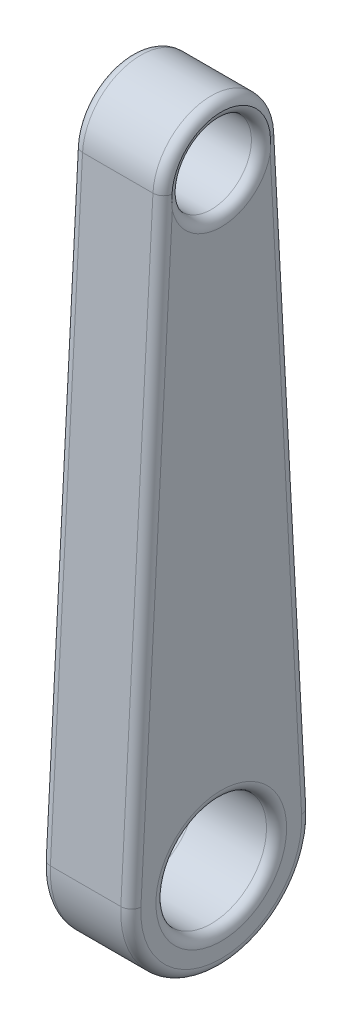
ISO-10303-21;
HEADER;
FILE_DESCRIPTION(('STEP AP214'),'2;1');
FILE_NAME('part.step','',(''),(''),'','','');
FILE_SCHEMA(('AUTOMOTIVE_DESIGN { 1 0 10303 214 1 1 1 1 }'));
ENDSEC;
DATA;
#1=APPLICATION_CONTEXT('core data for automotive mechanical design processes');
#2=APPLICATION_PROTOCOL_DEFINITION('international standard','automotive_design',2000,#1);
#3=PRODUCT_CONTEXT('',#1,'mechanical');
#4=PRODUCT('Part','Part','',(#3));
#5=PRODUCT_RELATED_PRODUCT_CATEGORY('part','',(#4));
#6=PRODUCT_DEFINITION_FORMATION('','',#4);
#7=PRODUCT_DEFINITION_CONTEXT('part definition',#1,'design');
#8=PRODUCT_DEFINITION('design','',#6,#7);
#9=PRODUCT_DEFINITION_SHAPE('','',#8);
#10=(LENGTH_UNIT() NAMED_UNIT(*) SI_UNIT(.MILLI.,.METRE.));
#11=(NAMED_UNIT(*) PLANE_ANGLE_UNIT() SI_UNIT($,.RADIAN.));
#12=(NAMED_UNIT(*) SI_UNIT($,.STERADIAN.) SOLID_ANGLE_UNIT());
#13=UNCERTAINTY_MEASURE_WITH_UNIT(LENGTH_MEASURE(1.E-05),#10,'distance_accuracy_value','');
#14=(GEOMETRIC_REPRESENTATION_CONTEXT(3) GLOBAL_UNCERTAINTY_ASSIGNED_CONTEXT((#13)) GLOBAL_UNIT_ASSIGNED_CONTEXT((#10,
#11,#12)) REPRESENTATION_CONTEXT('',''));
#15=CARTESIAN_POINT('',(0.,0.,0.));
#16=DIRECTION('',(0.,0.,1.));
#17=DIRECTION('',(1.,0.,0.));
#18=AXIS2_PLACEMENT_3D('',#15,#16,#17);
#19=CARTESIAN_POINT('',(5.715,76.2,0.));
#20=DIRECTION('',(1.,0.,0.));
#21=DIRECTION('',(0.,0.,-1.));
#22=AXIS2_PLACEMENT_3D('',#19,#20,#21);
#23=PLANE('',#22);
#24=CARTESIAN_POINT('',(5.715,0.,0.));
#25=DIRECTION('',(1.,0.,0.));
#26=DIRECTION('',(0.,0.,-1.));
#27=AXIS2_PLACEMENT_3D('',#24,#25,#26);
#28=CIRCLE('',#27,8.255);
#29=CARTESIAN_POINT('',(5.715,0.,-8.255));
#30=VERTEX_POINT('',#29);
#31=EDGE_CURVE('E321',#30,#30,#28,.F.);
#32=ORIENTED_EDGE('',*,*,#31,.T.);
#33=EDGE_LOOP('',(#32));
#34=FACE_BOUND('',#33,.T.);
#35=DIRECTION('',(0.,0.998576764978815,0.0533333333333333));
#36=VECTOR('',#35,1.);
#37=CARTESIAN_POINT('',(5.715,76.52512,-6.08732395931086));
#38=LINE('',#37,#36);
#39=CARTESIAN_POINT('',(5.715,0.541866666666666,-10.1455399321848));
#40=VERTEX_POINT('',#39);
#41=CARTESIAN_POINT('',(5.715,74.7496505118677,-6.18215062597753));
#42=VERTEX_POINT('',#41);
#43=EDGE_CURVE('E308',#40,#42,#38,.T.);
#44=ORIENTED_EDGE('',*,*,#43,.T.);
#45=CARTESIAN_POINT('',(5.715,76.2,0.));
#46=DIRECTION('',(1.,0.,0.));
#47=DIRECTION('',(0.,0.,-1.));
#48=AXIS2_PLACEMENT_3D('',#45,#46,#47);
#49=CIRCLE('',#48,6.35);
#50=CARTESIAN_POINT('',(5.715,74.7496505118677,6.18215062597753));
#51=VERTEX_POINT('',#50);
#52=EDGE_CURVE('E318',#42,#51,#49,.F.);
#53=ORIENTED_EDGE('',*,*,#52,.T.);
#54=DIRECTION('',(0.,-0.998576764978815,0.0533333333333333));
#55=VECTOR('',#54,1.);
#56=CARTESIAN_POINT('',(5.715,0.541866666666641,10.1455399321848));
#57=LINE('',#56,#55);
#58=CARTESIAN_POINT('',(5.715,0.541866666666664,10.1455399321848));
#59=VERTEX_POINT('',#58);
#60=EDGE_CURVE('E103',#51,#59,#57,.T.);
#61=ORIENTED_EDGE('',*,*,#60,.T.);
#62=CARTESIAN_POINT('',(5.715,0.,0.));
#63=DIRECTION('',(1.,0.,0.));
#64=DIRECTION('',(0.,0.,-1.));
#65=AXIS2_PLACEMENT_3D('',#62,#63,#64);
#66=CIRCLE('',#65,10.16);
#67=EDGE_CURVE('E312',#59,#40,#66,.T.);
#68=ORIENTED_EDGE('',*,*,#67,.T.);
#69=EDGE_LOOP('',(#44,#53,#61,#68));
#70=FACE_BOUND('',#69,.T.);
#71=ADVANCED_FACE('F39',(#34,#70),#23,.T.);
#72=CARTESIAN_POINT('',(-5.715,76.2,0.));
#73=DIRECTION('',(1.,0.,0.));
#74=DIRECTION('',(0.,0.,-1.));
#75=AXIS2_PLACEMENT_3D('',#72,#73,#74);
#76=PLANE('',#75);
#77=CARTESIAN_POINT('',(-5.715,0.,0.));
#78=DIRECTION('',(1.,0.,0.));
#79=DIRECTION('',(0.,0.,-1.));
#80=AXIS2_PLACEMENT_3D('',#77,#78,#79);
#81=CIRCLE('',#80,8.255);
#82=CARTESIAN_POINT('',(-5.715,0.,-8.255));
#83=VERTEX_POINT('',#82);
#84=EDGE_CURVE('E296',#83,#83,#81,.T.);
#85=ORIENTED_EDGE('',*,*,#84,.T.);
#86=EDGE_LOOP('',(#85));
#87=FACE_BOUND('',#86,.T.);
#88=CARTESIAN_POINT('',(-5.715,76.2,0.));
#89=DIRECTION('',(1.,0.,0.));
#90=DIRECTION('',(0.,0.,-1.));
#91=AXIS2_PLACEMENT_3D('',#88,#89,#90);
#92=CIRCLE('',#91,6.35);
#93=CARTESIAN_POINT('',(-5.715,74.7496505118677,6.18215062597753));
#94=VERTEX_POINT('',#93);
#95=CARTESIAN_POINT('',(-5.715,74.7496505118677,-6.18215062597753));
#96=VERTEX_POINT('',#95);
#97=EDGE_CURVE('E288',#94,#96,#92,.T.);
#98=ORIENTED_EDGE('',*,*,#97,.T.);
#99=DIRECTION('',(0.,0.998576764978815,0.0533333333333333));
#100=VECTOR('',#99,1.);
#101=CARTESIAN_POINT('',(-5.715,76.52512,-6.08732395931086));
#102=LINE('',#101,#100);
#103=CARTESIAN_POINT('',(-5.715,0.541866666666666,-10.1455399321848));
#104=VERTEX_POINT('',#103);
#105=EDGE_CURVE('E292',#96,#104,#102,.F.);
#106=ORIENTED_EDGE('',*,*,#105,.T.);
#107=CARTESIAN_POINT('',(-5.715,0.,0.));
#108=DIRECTION('',(1.,0.,0.));
#109=DIRECTION('',(0.,0.,-1.));
#110=AXIS2_PLACEMENT_3D('',#107,#108,#109);
#111=CIRCLE('',#110,10.16);
#112=CARTESIAN_POINT('',(-5.715,0.541866666666664,10.1455399321848));
#113=VERTEX_POINT('',#112);
#114=EDGE_CURVE('E280',#104,#113,#111,.F.);
#115=ORIENTED_EDGE('',*,*,#114,.T.);
#116=DIRECTION('',(0.,-0.998576764978815,0.0533333333333333));
#117=VECTOR('',#116,1.);
#118=CARTESIAN_POINT('',(-5.715,76.52512,6.08732395931086));
#119=LINE('',#118,#117);
#120=EDGE_CURVE('E284',#113,#94,#119,.F.);
#121=ORIENTED_EDGE('',*,*,#120,.T.);
#122=EDGE_LOOP('',(#98,#106,#115,#121));
#123=FACE_BOUND('',#122,.T.);
#124=ADVANCED_FACE('F156',(#87,#123),#76,.F.);
#125=CARTESIAN_POINT('',(5.715,76.2,0.));
#126=DIRECTION('',(-1.,0.,0.));
#127=DIRECTION('',(0.,0.,1.));
#128=AXIS2_PLACEMENT_3D('',#125,#126,#127);
#129=CYLINDRICAL_SURFACE('',#128,7.366);
#130=DIRECTION('',(-1.,0.,0.));
#131=VECTOR('',#130,1.);
#132=CARTESIAN_POINT('',(5.715,76.5928533333333,-7.35551645083395));
#133=LINE('',#132,#131);
#134=CARTESIAN_POINT('',(4.445,76.5928533333333,-7.35551645083395));
#135=VERTEX_POINT('',#134);
#136=CARTESIAN_POINT('',(-4.445,76.5928533333333,-7.35551645083395));
#137=VERTEX_POINT('',#136);
#138=EDGE_CURVE('E255',#135,#137,#133,.T.);
#139=ORIENTED_EDGE('',*,*,#138,.T.);
#140=CARTESIAN_POINT('',(-4.445,76.2,0.));
#141=DIRECTION('',(1.,0.,0.));
#142=DIRECTION('',(0.,0.,-1.));
#143=AXIS2_PLACEMENT_3D('',#140,#141,#142);
#144=CIRCLE('',#143,7.366);
#145=CARTESIAN_POINT('',(-4.445,76.5928533333333,7.35551645083395));
#146=VERTEX_POINT('',#145);
#147=EDGE_CURVE('E257',#137,#146,#144,.T.);
#148=ORIENTED_EDGE('',*,*,#147,.T.);
#149=DIRECTION('',(-1.,0.,0.));
#150=VECTOR('',#149,1.);
#151=CARTESIAN_POINT('',(5.715,76.5928533333333,7.35551645083395));
#152=LINE('',#151,#150);
#153=CARTESIAN_POINT('',(4.445,76.5928533333333,7.35551645083395));
#154=VERTEX_POINT('',#153);
#155=EDGE_CURVE('E249',#154,#146,#152,.T.);
#156=ORIENTED_EDGE('',*,*,#155,.F.);
#157=CARTESIAN_POINT('',(4.445,76.2,0.));
#158=DIRECTION('',(1.,0.,0.));
#159=DIRECTION('',(0.,0.,-1.));
#160=AXIS2_PLACEMENT_3D('',#157,#158,#159);
#161=CIRCLE('',#160,7.366);
#162=EDGE_CURVE('E92',#154,#135,#161,.F.);
#163=ORIENTED_EDGE('',*,*,#162,.T.);
#164=EDGE_LOOP('',(#139,#148,#156,#163));
#165=FACE_BOUND('',#164,.T.);
#166=ADVANCED_FACE('F162',(#165),#129,.T.);
#167=CARTESIAN_POINT('',(5.715,76.5928533333333,7.35551645083395));
#168=DIRECTION('',(0.,-0.0533333333333333,-0.998576764978815));
#169=DIRECTION('',(0.,0.998576764978815,-0.0533333333333333));
#170=AXIS2_PLACEMENT_3D('',#167,#168,#169);
#171=PLANE('',#170);
#172=ORIENTED_EDGE('',*,*,#155,.T.);
#173=DIRECTION('',(0.,-0.998576764978815,0.0533333333333333));
#174=VECTOR('',#173,1.);
#175=CARTESIAN_POINT('',(-4.445,76.5928533333333,7.35551645083395));
#176=LINE('',#175,#174);
#177=CARTESIAN_POINT('',(-4.445,0.609599999999997,11.4137324237079));
#178=VERTEX_POINT('',#177);
#179=EDGE_CURVE('E59',#146,#178,#176,.T.);
#180=ORIENTED_EDGE('',*,*,#179,.T.);
#181=DIRECTION('',(-1.,0.,0.));
#182=VECTOR('',#181,1.);
#183=CARTESIAN_POINT('',(5.715,0.609599999999997,11.4137324237079));
#184=LINE('',#183,#182);
#185=CARTESIAN_POINT('',(4.445,0.609599999999997,11.4137324237079));
#186=VERTEX_POINT('',#185);
#187=EDGE_CURVE('E269',#186,#178,#184,.T.);
#188=ORIENTED_EDGE('',*,*,#187,.F.);
#189=DIRECTION('',(0.,-0.998576764978815,0.0533333333333333));
#190=VECTOR('',#189,1.);
#191=CARTESIAN_POINT('',(4.445,76.5928533333333,7.35551645083395));
#192=LINE('',#191,#190);
#193=EDGE_CURVE('E333',#186,#154,#192,.F.);
#194=ORIENTED_EDGE('',*,*,#193,.T.);
#195=EDGE_LOOP('',(#172,#180,#188,#194));
#196=FACE_BOUND('',#195,.T.);
#197=ADVANCED_FACE('F178',(#196),#171,.F.);
#198=CARTESIAN_POINT('',(5.715,0.,0.));
#199=DIRECTION('',(-1.,0.,0.));
#200=DIRECTION('',(0.,0.,1.));
#201=AXIS2_PLACEMENT_3D('',#198,#199,#200);
#202=CYLINDRICAL_SURFACE('',#201,11.43);
#203=ORIENTED_EDGE('',*,*,#187,.T.);
#204=CARTESIAN_POINT('',(-4.445,0.,0.));
#205=DIRECTION('',(1.,0.,0.));
#206=DIRECTION('',(0.,0.,-1.));
#207=AXIS2_PLACEMENT_3D('',#204,#205,#206);
#208=CIRCLE('',#207,11.43);
#209=CARTESIAN_POINT('',(-4.445,0.609599999999999,-11.4137324237078));
#210=VERTEX_POINT('',#209);
#211=EDGE_CURVE('E11',#178,#210,#208,.T.);
#212=ORIENTED_EDGE('',*,*,#211,.T.);
#213=DIRECTION('',(-1.,0.,0.));
#214=VECTOR('',#213,1.);
#215=CARTESIAN_POINT('',(5.715,0.609599999999999,-11.4137324237078));
#216=LINE('',#215,#214);
#217=CARTESIAN_POINT('',(4.445,0.609599999999999,-11.4137324237078));
#218=VERTEX_POINT('',#217);
#219=EDGE_CURVE('E263',#218,#210,#216,.T.);
#220=ORIENTED_EDGE('',*,*,#219,.F.);
#221=CARTESIAN_POINT('',(4.445,0.,0.));
#222=DIRECTION('',(1.,0.,0.));
#223=DIRECTION('',(0.,0.,-1.));
#224=AXIS2_PLACEMENT_3D('',#221,#222,#223);
#225=CIRCLE('',#224,11.43);
#226=EDGE_CURVE('E50',#218,#186,#225,.F.);
#227=ORIENTED_EDGE('',*,*,#226,.T.);
#228=EDGE_LOOP('',(#203,#212,#220,#227));
#229=FACE_BOUND('',#228,.T.);
#230=ADVANCED_FACE('F174',(#229),#202,.T.);
#231=CARTESIAN_POINT('',(5.715,0.609599999999999,-11.4137324237078));
#232=DIRECTION('',(0.,-0.0533333333333333,0.998576764978815));
#233=DIRECTION('',(0.,-0.998576764978815,-0.0533333333333333));
#234=AXIS2_PLACEMENT_3D('',#231,#232,#233);
#235=PLANE('',#234);
#236=ORIENTED_EDGE('',*,*,#219,.T.);
#237=DIRECTION('',(0.,0.998576764978815,0.0533333333333333));
#238=VECTOR('',#237,1.);
#239=CARTESIAN_POINT('',(-4.445,0.609599999999999,-11.4137324237078));
#240=LINE('',#239,#238);
#241=EDGE_CURVE('E248',#210,#137,#240,.T.);
#242=ORIENTED_EDGE('',*,*,#241,.T.);
#243=ORIENTED_EDGE('',*,*,#138,.F.);
#244=DIRECTION('',(0.,0.998576764978815,0.0533333333333333));
#245=VECTOR('',#244,1.);
#246=CARTESIAN_POINT('',(4.445,0.609599999999974,-11.4137324237079));
#247=LINE('',#246,#245);
#248=EDGE_CURVE('E238',#135,#218,#247,.F.);
#249=ORIENTED_EDGE('',*,*,#248,.T.);
#250=EDGE_LOOP('',(#236,#242,#243,#249));
#251=FACE_BOUND('',#250,.T.);
#252=ADVANCED_FACE('F171',(#251),#235,.F.);
#253=CARTESIAN_POINT('',(5.715,0.,0.));
#254=DIRECTION('',(-1.,0.,0.));
#255=DIRECTION('',(0.,0.,1.));
#256=AXIS2_PLACEMENT_3D('',#253,#254,#255);
#257=CYLINDRICAL_SURFACE('',#256,6.985);
#258=CARTESIAN_POINT('',(-4.445,0.,0.));
#259=DIRECTION('',(1.,0.,0.));
#260=DIRECTION('',(0.,0.,-1.));
#261=AXIS2_PLACEMENT_3D('',#258,#259,#260);
#262=CIRCLE('',#261,6.985);
#263=CARTESIAN_POINT('',(-4.445,0.,-6.985));
#264=VERTEX_POINT('',#263);
#265=EDGE_CURVE('E258',#264,#264,#262,.F.);
#266=ORIENTED_EDGE('',*,*,#265,.T.);
#267=EDGE_LOOP('',(#266));
#268=FACE_BOUND('',#267,.T.);
#269=CARTESIAN_POINT('',(4.445,0.,0.));
#270=DIRECTION('',(1.,0.,0.));
#271=DIRECTION('',(0.,0.,-1.));
#272=AXIS2_PLACEMENT_3D('',#269,#270,#271);
#273=CIRCLE('',#272,6.985);
#274=CARTESIAN_POINT('',(4.445,0.,-6.985));
#275=VERTEX_POINT('',#274);
#276=EDGE_CURVE('E324',#275,#275,#273,.T.);
#277=ORIENTED_EDGE('',*,*,#276,.T.);
#278=EDGE_LOOP('',(#277));
#279=FACE_BOUND('',#278,.T.);
#280=ADVANCED_FACE('F168',(#268,#279),#257,.F.);
#281=CARTESIAN_POINT('',(5.715,76.2,0.));
#282=DIRECTION('',(-1.,0.,0.));
#283=DIRECTION('',(0.,0.,1.));
#284=AXIS2_PLACEMENT_3D('',#281,#282,#283);
#285=CYLINDRICAL_SURFACE('',#284,5.08);
#286=CARTESIAN_POINT('',(-4.445,76.2,0.));
#287=DIRECTION('',(1.,0.,0.));
#288=DIRECTION('',(0.,0.,-1.));
#289=AXIS2_PLACEMENT_3D('',#286,#287,#288);
#290=CIRCLE('',#289,5.08);
#291=CARTESIAN_POINT('',(-4.445,76.2,-5.08));
#292=VERTEX_POINT('',#291);
#293=EDGE_CURVE('E304',#292,#292,#290,.F.);
#294=ORIENTED_EDGE('',*,*,#293,.T.);
#295=EDGE_LOOP('',(#294));
#296=FACE_BOUND('',#295,.T.);
#297=CARTESIAN_POINT('',(4.445,76.2,0.));
#298=DIRECTION('',(1.,0.,0.));
#299=DIRECTION('',(0.,0.,-1.));
#300=AXIS2_PLACEMENT_3D('',#297,#298,#299);
#301=CIRCLE('',#300,5.08);
#302=CARTESIAN_POINT('',(4.445,76.2,-5.08));
#303=VERTEX_POINT('',#302);
#304=EDGE_CURVE('E300',#303,#303,#301,.T.);
#305=ORIENTED_EDGE('',*,*,#304,.T.);
#306=EDGE_LOOP('',(#305));
#307=FACE_BOUND('',#306,.T.);
#308=ADVANCED_FACE('F403',(#296,#307),#285,.F.);
#309=CARTESIAN_POINT('',(-4.445,76.52512,6.08732395931086));
#310=DIRECTION('',(0.,-0.998576764978815,0.0533333333333333));
#311=DIRECTION('',(0.,-0.0533333333333333,-0.998576764978815));
#312=AXIS2_PLACEMENT_3D('',#309,#310,#311);
#313=CYLINDRICAL_SURFACE('',#312,1.27);
#314=CARTESIAN_POINT('',(-5.70864918591077,76.5930533333333,6.21072573866104));
#315=CARTESIAN_POINT('',(-5.7085328628646,76.4404662210844,6.21963418032231));
#316=CARTESIAN_POINT('',(-5.70877882812543,76.2877151907581,6.22572102409376));
#317=CARTESIAN_POINT('',(-5.70973132833839,75.982074947062,6.23227634165801));
#318=CARTESIAN_POINT('',(-5.71043791993803,75.8291857190063,6.23274412428509));
#319=CARTESIAN_POINT('',(-5.71204543652754,75.5239005161188,6.22809012683859));
#320=CARTESIAN_POINT('',(-5.71294584273172,75.3715043059793,6.22298312310563));
#321=CARTESIAN_POINT('',(-5.7144065278931,75.0670110821416,6.20726427944732));
#322=CARTESIAN_POINT('',(-5.71496685988026,74.9149140254835,6.19665329827154));
#323=CARTESIAN_POINT('',(-5.71499951629451,74.7585952318228,6.18294228812307));
#324=CARTESIAN_POINT('',(-5.71499999204668,74.7541227615327,6.18254763111978));
#325=CARTESIAN_POINT('',(-5.71500000000006,74.7496505118677,6.18215062597752));
#326=B_SPLINE_CURVE_WITH_KNOTS('',3,(#314,#315,#316,#317,#318,#319,#320,#321,#322,#323,#324,
#325),.UNSPECIFIED.,.F.,.F.,(4,2,2,2,2,4),(0.,0.458513515560254,0.917083429436195,
1.37444081822411,1.83172686998677,1.84519641427954),.UNSPECIFIED.);
#327=CARTESIAN_POINT('',(-5.70863404512541,76.5318933333333,6.21414320846317));
#328=VERTEX_POINT('',#327);
#329=EDGE_CURVE('E208',#94,#328,#326,.F.);
#330=ORIENTED_EDGE('',*,*,#329,.F.);
#331=ORIENTED_EDGE('',*,*,#120,.F.);
#332=CARTESIAN_POINT('',(-4.445,0.541866666666664,10.1455399321848));
#333=DIRECTION('',(0.,-0.998576764978815,0.0533333333333334));
#334=DIRECTION('',(0.,-0.0533333333333334,-0.998576764978815));
#335=AXIS2_PLACEMENT_3D('',#332,#333,#334);
#336=CIRCLE('',#335,1.27);
#337=EDGE_CURVE('E264',#178,#113,#336,.T.);
#338=ORIENTED_EDGE('',*,*,#337,.F.);
#339=ORIENTED_EDGE('',*,*,#179,.F.);
#340=CARTESIAN_POINT('',(-4.445,76.52512,6.08732395931086));
#341=DIRECTION('',(0.,0.998576764978815,-0.0533333333333335));
#342=DIRECTION('',(0.,0.0533333333333335,0.998576764978815));
#343=AXIS2_PLACEMENT_3D('',#340,#341,#342);
#344=CIRCLE('',#343,1.27);
#345=EDGE_CURVE('E272',#328,#146,#344,.T.);
#346=ORIENTED_EDGE('',*,*,#345,.F.);
#347=EDGE_LOOP('',(#330,#331,#338,#339,#346));
#348=FACE_BOUND('',#347,.T.);
#349=ADVANCED_FACE('F220',(#348),#313,.T.);
#350=CARTESIAN_POINT('',(-4.445,0.,0.));
#351=DIRECTION('',(1.,0.,0.));
#352=DIRECTION('',(0.,0.,-1.));
#353=AXIS2_PLACEMENT_3D('',#350,#351,#352);
#354=TOROIDAL_SURFACE('',#353,10.16,1.27);
#355=ORIENTED_EDGE('',*,*,#337,.T.);
#356=ORIENTED_EDGE('',*,*,#114,.F.);
#357=CARTESIAN_POINT('',(-4.445,0.541866666666666,-10.1455399321848));
#358=DIRECTION('',(0.,0.998576764978815,0.0533333333333334));
#359=DIRECTION('',(0.,-0.0533333333333334,0.998576764978815));
#360=AXIS2_PLACEMENT_3D('',#357,#358,#359);
#361=CIRCLE('',#360,1.27);
#362=EDGE_CURVE('E204',#210,#104,#361,.T.);
#363=ORIENTED_EDGE('',*,*,#362,.F.);
#364=ORIENTED_EDGE('',*,*,#211,.F.);
#365=EDGE_LOOP('',(#355,#356,#363,#364));
#366=FACE_BOUND('',#365,.T.);
#367=ADVANCED_FACE('F227',(#366),#354,.T.);
#368=CARTESIAN_POINT('',(-4.445,76.2,0.));
#369=DIRECTION('',(1.,0.,0.));
#370=DIRECTION('',(0.,0.,-1.));
#371=AXIS2_PLACEMENT_3D('',#368,#369,#370);
#372=TOROIDAL_SURFACE('',#371,6.096,1.27);
#373=CARTESIAN_POINT('',(-5.70863404512541,76.2,0.));
#374=DIRECTION('',(1.,0.,0.));
#375=DIRECTION('',(0.,0.,-1.));
#376=AXIS2_PLACEMENT_3D('',#373,#374,#375);
#377=CIRCLE('',#376,6.223);
#378=CARTESIAN_POINT('',(-5.70863404512541,76.5318933333333,-6.21414320846317));
#379=VERTEX_POINT('',#378);
#380=EDGE_CURVE('E218',#328,#379,#377,.F.);
#381=ORIENTED_EDGE('',*,*,#380,.F.);
#382=ORIENTED_EDGE('',*,*,#345,.T.);
#383=ORIENTED_EDGE('',*,*,#147,.F.);
#384=CARTESIAN_POINT('',(-4.445,76.52512,-6.08732395931086));
#385=DIRECTION('',(0.,-0.998576764978815,-0.0533333333333335));
#386=DIRECTION('',(0.,0.0533333333333335,-0.998576764978815));
#387=AXIS2_PLACEMENT_3D('',#384,#385,#386);
#388=CIRCLE('',#387,1.27);
#389=EDGE_CURVE('E199',#379,#137,#388,.T.);
#390=ORIENTED_EDGE('',*,*,#389,.F.);
#391=EDGE_LOOP('',(#381,#382,#383,#390));
#392=FACE_BOUND('',#391,.T.);
#393=ADVANCED_FACE('F224',(#392),#372,.T.);
#394=CARTESIAN_POINT('',(-4.445,76.2,0.));
#395=DIRECTION('',(1.,0.,0.));
#396=DIRECTION('',(0.,0.,-1.));
#397=AXIS2_PLACEMENT_3D('',#394,#395,#396);
#398=TOROIDAL_SURFACE('',#397,6.35,1.27);
#399=ORIENTED_EDGE('',*,*,#293,.F.);
#400=EDGE_LOOP('',(#399));
#401=FACE_BOUND('',#400,.T.);
#402=ORIENTED_EDGE('',*,*,#329,.T.);
#403=ORIENTED_EDGE('',*,*,#380,.T.);
#404=CARTESIAN_POINT('',(-5.71500000000002,74.7496505118676,-6.18215062597757));
#405=CARTESIAN_POINT('',(-5.71499999204666,74.7541227615327,-6.18254763111982));
#406=CARTESIAN_POINT('',(-5.71499951629449,74.7585952318228,-6.18294228812311));
#407=CARTESIAN_POINT('',(-5.71496685988071,74.9149140254835,-6.19665329827133));
#408=CARTESIAN_POINT('',(-5.71440652789322,75.0670110821416,-6.20726427944726));
#409=CARTESIAN_POINT('',(-5.7129458427316,75.3715043059793,-6.22298312310568));
#410=CARTESIAN_POINT('',(-5.7120454365275,75.5239005161189,-6.2280901268386));
#411=CARTESIAN_POINT('',(-5.71043791993806,75.8291857190064,-6.23274412428508));
#412=CARTESIAN_POINT('',(-5.70973132833841,75.982074947062,-6.232276341658));
#413=CARTESIAN_POINT('',(-5.70877882812541,76.2877151907581,-6.22572102409376));
#414=CARTESIAN_POINT('',(-5.70853286286456,76.4404662210844,-6.21963418032232));
#415=CARTESIAN_POINT('',(-5.70864918591077,76.5930533333333,-6.21072573866104));
#416=B_SPLINE_CURVE_WITH_KNOTS('',3,(#404,#405,#406,#407,#408,#409,#410,#411,#412,#413,#414,
#415),.UNSPECIFIED.,.F.,.F.,(4,2,2,2,2,4),(0.,0.0134695442927614,0.470755596055463,
0.928112984843393,1.38668289871928,1.84519641427953),.UNSPECIFIED.);
#417=EDGE_CURVE('E191',#96,#379,#416,.T.);
#418=ORIENTED_EDGE('',*,*,#417,.F.);
#419=ORIENTED_EDGE('',*,*,#97,.F.);
#420=EDGE_LOOP('',(#402,#403,#418,#419));
#421=FACE_BOUND('',#420,.T.);
#422=ADVANCED_FACE('F187',(#401,#421),#398,.T.);
#423=CARTESIAN_POINT('',(-4.445,0.541866666666666,-10.1455399321848));
#424=DIRECTION('',(0.,0.998576764978815,0.0533333333333333));
#425=DIRECTION('',(0.,-0.0533333333333333,0.998576764978815));
#426=AXIS2_PLACEMENT_3D('',#423,#424,#425);
#427=CYLINDRICAL_SURFACE('',#426,1.27);
#428=ORIENTED_EDGE('',*,*,#362,.T.);
#429=ORIENTED_EDGE('',*,*,#105,.F.);
#430=ORIENTED_EDGE('',*,*,#417,.T.);
#431=ORIENTED_EDGE('',*,*,#389,.T.);
#432=ORIENTED_EDGE('',*,*,#241,.F.);
#433=EDGE_LOOP('',(#428,#429,#430,#431,#432));
#434=FACE_BOUND('',#433,.T.);
#435=ADVANCED_FACE('F145',(#434),#427,.T.);
#436=CARTESIAN_POINT('',(4.445,0.,0.));
#437=DIRECTION('',(1.,0.,0.));
#438=DIRECTION('',(0.,0.,-1.));
#439=AXIS2_PLACEMENT_3D('',#436,#437,#438);
#440=TOROIDAL_SURFACE('',#439,10.16,1.27);
#441=CARTESIAN_POINT('',(4.445,0.541866666666666,-10.1455399321848));
#442=DIRECTION('',(0.,0.998576764978815,0.0533333333333334));
#443=DIRECTION('',(0.,-0.0533333333333334,0.998576764978815));
#444=AXIS2_PLACEMENT_3D('',#441,#442,#443);
#445=CIRCLE('',#444,1.27);
#446=EDGE_CURVE('E108',#40,#218,#445,.T.);
#447=ORIENTED_EDGE('',*,*,#446,.F.);
#448=ORIENTED_EDGE('',*,*,#67,.F.);
#449=CARTESIAN_POINT('',(4.445,0.541866666666664,10.1455399321848));
#450=DIRECTION('',(0.,0.998576764978815,-0.0533333333333332));
#451=DIRECTION('',(0.,0.0533333333333332,0.998576764978815));
#452=AXIS2_PLACEMENT_3D('',#449,#450,#451);
#453=CIRCLE('',#452,1.27);
#454=EDGE_CURVE('E43',#186,#59,#453,.T.);
#455=ORIENTED_EDGE('',*,*,#454,.F.);
#456=ORIENTED_EDGE('',*,*,#226,.F.);
#457=EDGE_LOOP('',(#447,#448,#455,#456));
#458=FACE_BOUND('',#457,.T.);
#459=ADVANCED_FACE('F137',(#458),#440,.T.);
#460=CARTESIAN_POINT('',(4.445,76.52512,6.08732395931086));
#461=DIRECTION('',(0.,0.998576764978815,-0.0533333333333333));
#462=DIRECTION('',(0.,0.0533333333333333,0.998576764978815));
#463=AXIS2_PLACEMENT_3D('',#460,#461,#462);
#464=CYLINDRICAL_SURFACE('',#463,1.27);
#465=CARTESIAN_POINT('',(4.445,76.52512,6.08732395931086));
#466=DIRECTION('',(0.,0.998576764978815,-0.0533333333333335));
#467=DIRECTION('',(0.,0.0533333333333335,0.998576764978815));
#468=AXIS2_PLACEMENT_3D('',#465,#466,#467);
#469=CIRCLE('',#468,1.27);
#470=CARTESIAN_POINT('',(5.70863404512541,76.5318933333333,6.21414320846317));
#471=VERTEX_POINT('',#470);
#472=EDGE_CURVE('E84',#154,#471,#469,.T.);
#473=ORIENTED_EDGE('',*,*,#472,.F.);
#474=ORIENTED_EDGE('',*,*,#193,.F.);
#475=ORIENTED_EDGE('',*,*,#454,.T.);
#476=ORIENTED_EDGE('',*,*,#60,.F.);
#477=CARTESIAN_POINT('',(5.70864918591077,76.5930533333333,6.21072573866104));
#478=CARTESIAN_POINT('',(5.7085328628646,76.4404662210844,6.2196341803223));
#479=CARTESIAN_POINT('',(5.70877882812543,76.2877151907581,6.22572102409375));
#480=CARTESIAN_POINT('',(5.70973132833839,75.982074947062,6.23227634165802));
#481=CARTESIAN_POINT('',(5.71043791993803,75.8291857190063,6.23274412428511));
#482=CARTESIAN_POINT('',(5.71204543652754,75.5239005161188,6.22809012683858));
#483=CARTESIAN_POINT('',(5.71294584273172,75.3715043059793,6.22298312310559));
#484=CARTESIAN_POINT('',(5.7144065278931,75.0670110821416,6.20726427944735));
#485=CARTESIAN_POINT('',(5.71496685988026,74.9149140254835,6.19665329827166));
#486=CARTESIAN_POINT('',(5.71499951629451,74.7585952318228,6.18294228812308));
#487=CARTESIAN_POINT('',(5.71499999204668,74.7541227615327,6.18254763111978));
#488=CARTESIAN_POINT('',(5.71500000000006,74.7496505118677,6.18215062597752));
#489=B_SPLINE_CURVE_WITH_KNOTS('',3,(#477,#478,#479,#480,#481,#482,#483,#484,#485,#486,#487,
#488),.UNSPECIFIED.,.F.,.F.,(4,2,2,2,2,4),(0.,0.458513515560254,0.917083429436223,
1.37444081822412,1.83172686998677,1.84519641427952),.UNSPECIFIED.);
#490=EDGE_CURVE('E98',#471,#51,#489,.T.);
#491=ORIENTED_EDGE('',*,*,#490,.F.);
#492=EDGE_LOOP('',(#473,#474,#475,#476,#491));
#493=FACE_BOUND('',#492,.T.);
#494=ADVANCED_FACE('F99',(#493),#464,.T.);
#495=CARTESIAN_POINT('',(4.445,76.2,0.));
#496=DIRECTION('',(1.,0.,0.));
#497=DIRECTION('',(0.,0.,-1.));
#498=AXIS2_PLACEMENT_3D('',#495,#496,#497);
#499=TOROIDAL_SURFACE('',#498,6.096,1.27);
#500=CARTESIAN_POINT('',(4.445,76.52512,-6.08732395931086));
#501=DIRECTION('',(0.,-0.998576764978815,-0.0533333333333335));
#502=DIRECTION('',(0.,0.0533333333333335,-0.998576764978815));
#503=AXIS2_PLACEMENT_3D('',#500,#501,#502);
#504=CIRCLE('',#503,1.27);
#505=CARTESIAN_POINT('',(5.70863404512541,76.5318933333493,-6.21414320846231));
#506=VERTEX_POINT('',#505);
#507=EDGE_CURVE('E78',#135,#506,#504,.T.);
#508=ORIENTED_EDGE('',*,*,#507,.F.);
#509=ORIENTED_EDGE('',*,*,#162,.F.);
#510=ORIENTED_EDGE('',*,*,#472,.T.);
#511=CARTESIAN_POINT('',(5.70863404512541,76.2,0.));
#512=DIRECTION('',(1.,0.,0.));
#513=DIRECTION('',(0.,0.,-1.));
#514=AXIS2_PLACEMENT_3D('',#511,#512,#513);
#515=CIRCLE('',#514,6.223);
#516=EDGE_CURVE('E88',#506,#471,#515,.T.);
#517=ORIENTED_EDGE('',*,*,#516,.F.);
#518=EDGE_LOOP('',(#508,#509,#510,#517));
#519=FACE_BOUND('',#518,.T.);
#520=ADVANCED_FACE('F86',(#519),#499,.T.);
#521=CARTESIAN_POINT('',(4.445,76.52512,-6.08732395931086));
#522=DIRECTION('',(0.,-0.998576764978815,-0.0533333333333333));
#523=DIRECTION('',(0.,0.0533333333333333,-0.998576764978815));
#524=AXIS2_PLACEMENT_3D('',#521,#522,#523);
#525=CYLINDRICAL_SURFACE('',#524,1.27);
#526=ORIENTED_EDGE('',*,*,#248,.F.);
#527=ORIENTED_EDGE('',*,*,#507,.T.);
#528=CARTESIAN_POINT('',(5.71500000000002,74.7496505118677,-6.18215062597752));
#529=CARTESIAN_POINT('',(5.71499999204666,74.7541227615327,-6.18254763111979));
#530=CARTESIAN_POINT('',(5.71499951629449,74.7585952318228,-6.18294228812311));
#531=CARTESIAN_POINT('',(5.71496685988071,74.9149140254834,-6.19665329827215));
#532=CARTESIAN_POINT('',(5.71440652789322,75.0670110821415,-6.20726427944748));
#533=CARTESIAN_POINT('',(5.7129458427316,75.3715043059792,-6.22298312310546));
#534=CARTESIAN_POINT('',(5.7120454365275,75.5239005161187,-6.22809012683853));
#535=CARTESIAN_POINT('',(5.71043791993806,75.8291857190062,-6.23274412428514));
#536=CARTESIAN_POINT('',(5.70973132833841,75.982074947062,-6.23227634165804));
#537=CARTESIAN_POINT('',(5.70877882812541,76.2877151907581,-6.22572102409373));
#538=CARTESIAN_POINT('',(5.70853286286456,76.4404662210844,-6.21963418032226));
#539=CARTESIAN_POINT('',(5.70864918591077,76.5930533333333,-6.21072573866103));
#540=B_SPLINE_CURVE_WITH_KNOTS('',3,(#528,#529,#530,#531,#532,#533,#534,#535,#536,#537,#538,
#539),.UNSPECIFIED.,.F.,.F.,(4,2,2,2,2,4),(0.,0.013469544292754,0.470755596055302,
0.928112984843204,1.38668289871927,1.84519641427954),.UNSPECIFIED.);
#541=EDGE_CURVE('E112',#42,#506,#540,.T.);
#542=ORIENTED_EDGE('',*,*,#541,.F.);
#543=ORIENTED_EDGE('',*,*,#43,.F.);
#544=ORIENTED_EDGE('',*,*,#446,.T.);
#545=EDGE_LOOP('',(#526,#527,#542,#543,#544));
#546=FACE_BOUND('',#545,.T.);
#547=ADVANCED_FACE('F141',(#546),#525,.T.);
#548=CARTESIAN_POINT('',(4.445,76.2,0.));
#549=DIRECTION('',(1.,0.,0.));
#550=DIRECTION('',(0.,0.,-1.));
#551=AXIS2_PLACEMENT_3D('',#548,#549,#550);
#552=TOROIDAL_SURFACE('',#551,6.35,1.27);
#553=ORIENTED_EDGE('',*,*,#516,.T.);
#554=ORIENTED_EDGE('',*,*,#490,.T.);
#555=ORIENTED_EDGE('',*,*,#52,.F.);
#556=ORIENTED_EDGE('',*,*,#541,.T.);
#557=EDGE_LOOP('',(#553,#554,#555,#556));
#558=FACE_BOUND('',#557,.T.);
#559=ORIENTED_EDGE('',*,*,#304,.F.);
#560=EDGE_LOOP('',(#559));
#561=FACE_BOUND('',#560,.T.);
#562=ADVANCED_FACE('F110',(#558,#561),#552,.T.);
#563=CARTESIAN_POINT('',(-4.445,0.,0.));
#564=DIRECTION('',(1.,0.,0.));
#565=DIRECTION('',(0.,0.,-1.));
#566=AXIS2_PLACEMENT_3D('',#563,#564,#565);
#567=TOROIDAL_SURFACE('',#566,8.255,1.27);
#568=ORIENTED_EDGE('',*,*,#265,.F.);
#569=EDGE_LOOP('',(#568));
#570=FACE_BOUND('',#569,.T.);
#571=ORIENTED_EDGE('',*,*,#84,.F.);
#572=EDGE_LOOP('',(#571));
#573=FACE_BOUND('',#572,.T.);
#574=ADVANCED_FACE('F140',(#570,#573),#567,.T.);
#575=CARTESIAN_POINT('',(4.445,0.,0.));
#576=DIRECTION('',(1.,0.,0.));
#577=DIRECTION('',(0.,0.,-1.));
#578=AXIS2_PLACEMENT_3D('',#575,#576,#577);
#579=TOROIDAL_SURFACE('',#578,8.255,1.27);
#580=ORIENTED_EDGE('',*,*,#31,.F.);
#581=EDGE_LOOP('',(#580));
#582=FACE_BOUND('',#581,.T.);
#583=ORIENTED_EDGE('',*,*,#276,.F.);
#584=EDGE_LOOP('',(#583));
#585=FACE_BOUND('',#584,.T.);
#586=ADVANCED_FACE('F41',(#582,#585),#579,.T.);
#587=CLOSED_SHELL('',(#71,#124,#166,#197,#230,#252,#280,#308,#349,#367,#393,#422,#435,#459,#494,
#520,#547,#562,#574,#586));
#588=MANIFOLD_SOLID_BREP('B2',#587);
#589=ADVANCED_BREP_SHAPE_REPRESENTATION('',(#18,#588),#14);
#590=SHAPE_DEFINITION_REPRESENTATION(#9,#589);
ENDSEC;
END-ISO-10303-21;
